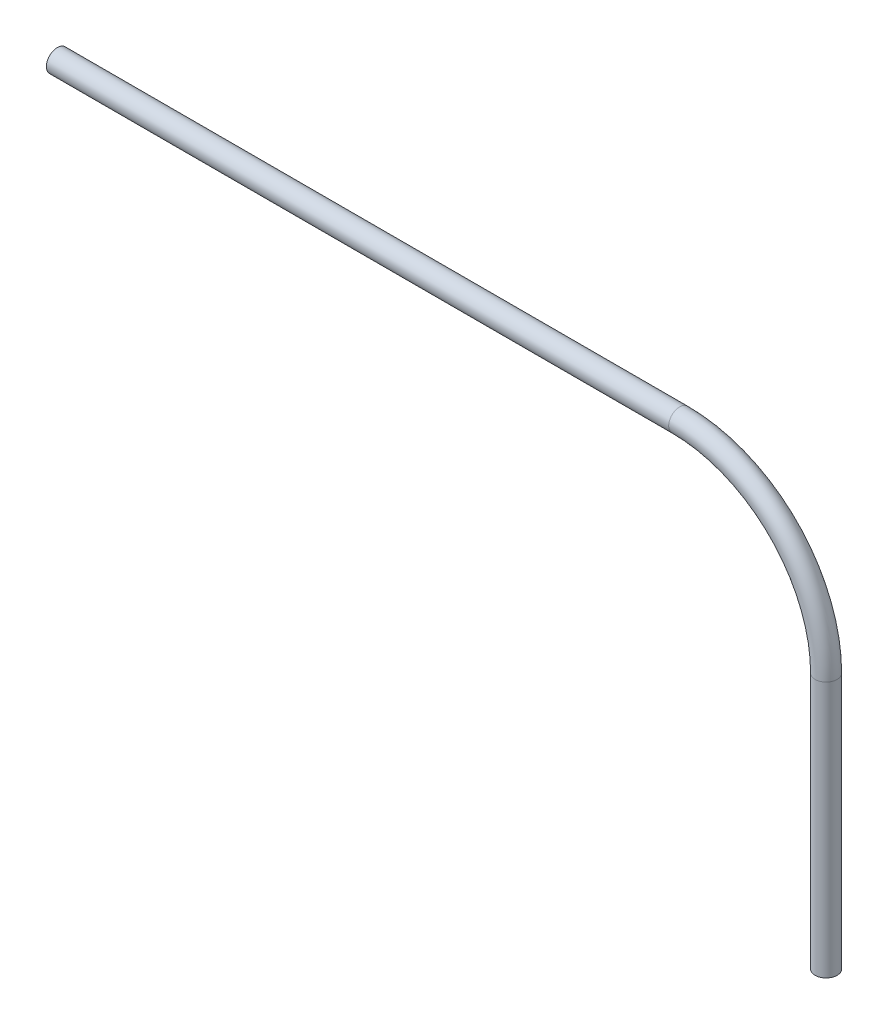
ISO-10303-21;
HEADER;
FILE_DESCRIPTION(('STEP AP214'),'2;1');
FILE_NAME('part.step','',(''),(''),'','','');
FILE_SCHEMA(('AUTOMOTIVE_DESIGN { 1 0 10303 214 1 1 1 1 }'));
ENDSEC;
DATA;
#1=APPLICATION_CONTEXT('core data for automotive mechanical design processes');
#2=APPLICATION_PROTOCOL_DEFINITION('international standard','automotive_design',2000,#1);
#3=PRODUCT_CONTEXT('',#1,'mechanical');
#4=PRODUCT('Part','Part','',(#3));
#5=PRODUCT_RELATED_PRODUCT_CATEGORY('part','',(#4));
#6=PRODUCT_DEFINITION_FORMATION('','',#4);
#7=PRODUCT_DEFINITION_CONTEXT('part definition',#1,'design');
#8=PRODUCT_DEFINITION('design','',#6,#7);
#9=PRODUCT_DEFINITION_SHAPE('','',#8);
#10=(LENGTH_UNIT() NAMED_UNIT(*) SI_UNIT(.MILLI.,.METRE.));
#11=(NAMED_UNIT(*) PLANE_ANGLE_UNIT() SI_UNIT($,.RADIAN.));
#12=(NAMED_UNIT(*) SI_UNIT($,.STERADIAN.) SOLID_ANGLE_UNIT());
#13=UNCERTAINTY_MEASURE_WITH_UNIT(LENGTH_MEASURE(1.E-05),#10,'distance_accuracy_value','');
#14=(GEOMETRIC_REPRESENTATION_CONTEXT(3) GLOBAL_UNCERTAINTY_ASSIGNED_CONTEXT((#13)) GLOBAL_UNIT_ASSIGNED_CONTEXT((#10,
#11,#12)) REPRESENTATION_CONTEXT('',''));
#15=CARTESIAN_POINT('',(0.,0.,0.));
#16=DIRECTION('',(0.,0.,1.));
#17=DIRECTION('',(1.,0.,0.));
#18=AXIS2_PLACEMENT_3D('',#15,#16,#17);
#19=CARTESIAN_POINT('',(4624.96017695695,-100.000000000001,0.));
#20=DIRECTION('',(0.,-1.,0.));
#21=DIRECTION('',(0.,0.,-1.));
#22=AXIS2_PLACEMENT_3D('',#19,#20,#21);
#23=PLANE('',#22);
#24=CARTESIAN_POINT('',(4624.96017695695,-100.000000000001,0.));
#25=DIRECTION('',(0.,-1.,0.));
#26=DIRECTION('',(1.,0.,0.));
#27=AXIS2_PLACEMENT_3D('',#24,#25,#26);
#28=CIRCLE('',#27,27.);
#29=CARTESIAN_POINT('',(4651.96017695695,-100.000000000001,0.));
#30=VERTEX_POINT('',#29);
#31=EDGE_CURVE('E70',#30,#30,#28,.T.);
#32=ORIENTED_EDGE('',*,*,#31,.F.);
#33=EDGE_LOOP('',(#32));
#34=FACE_BOUND('',#33,.T.);
#35=CARTESIAN_POINT('',(4624.96017695695,-100.000000000001,0.));
#36=DIRECTION('',(0.,-1.,0.));
#37=DIRECTION('',(0.,0.,-1.));
#38=AXIS2_PLACEMENT_3D('',#35,#36,#37);
#39=CIRCLE('',#38,30.);
#40=CARTESIAN_POINT('',(4624.96017695695,-100.000000000001,-30.));
#41=VERTEX_POINT('',#40);
#42=EDGE_CURVE('E61',#41,#41,#39,.T.);
#43=ORIENTED_EDGE('',*,*,#42,.T.);
#44=EDGE_LOOP('',(#43));
#45=FACE_BOUND('',#44,.T.);
#46=ADVANCED_FACE('F47',(#34,#45),#23,.T.);
#47=CARTESIAN_POINT('',(2524.96017695695,999.999999999999,0.));
#48=DIRECTION('',(1.,0.,0.));
#49=DIRECTION('',(0.,0.,-1.));
#50=AXIS2_PLACEMENT_3D('',#47,#48,#49);
#51=PLANE('',#50);
#52=CARTESIAN_POINT('',(2524.96017695695,999.999999999999,0.));
#53=DIRECTION('',(1.,0.,0.));
#54=DIRECTION('',(0.,0.,-1.));
#55=AXIS2_PLACEMENT_3D('',#52,#53,#54);
#56=CIRCLE('',#55,27.);
#57=CARTESIAN_POINT('',(2524.96017695695,999.999999999999,-27.));
#58=VERTEX_POINT('',#57);
#59=EDGE_CURVE('E66',#58,#58,#56,.T.);
#60=ORIENTED_EDGE('',*,*,#59,.T.);
#61=EDGE_LOOP('',(#60));
#62=FACE_BOUND('',#61,.T.);
#63=CARTESIAN_POINT('',(2524.96017695695,999.999999999999,0.));
#64=DIRECTION('',(1.,0.,0.));
#65=DIRECTION('',(0.,0.,-1.));
#66=AXIS2_PLACEMENT_3D('',#63,#64,#65);
#67=CIRCLE('',#66,30.);
#68=CARTESIAN_POINT('',(2524.96017695695,999.999999999999,-30.));
#69=VERTEX_POINT('',#68);
#70=EDGE_CURVE('E11',#69,#69,#67,.T.);
#71=ORIENTED_EDGE('',*,*,#70,.F.);
#72=EDGE_LOOP('',(#71));
#73=FACE_BOUND('',#72,.T.);
#74=ADVANCED_FACE('F90',(#62,#73),#51,.F.);
#75=CARTESIAN_POINT('',(4624.96017695695,-100.000000000001,0.));
#76=DIRECTION('',(0.,1.,0.));
#77=DIRECTION('',(0.,0.,1.));
#78=AXIS2_PLACEMENT_3D('',#75,#76,#77);
#79=CYLINDRICAL_SURFACE('',#78,30.);
#80=CARTESIAN_POINT('',(4624.96017695695,600.,0.));
#81=DIRECTION('',(0.,-1.,0.));
#82=DIRECTION('',(0.,0.,-1.));
#83=AXIS2_PLACEMENT_3D('',#80,#81,#82);
#84=CIRCLE('',#83,30.);
#85=CARTESIAN_POINT('',(4654.96017695695,600.,0.));
#86=VERTEX_POINT('',#85);
#87=EDGE_CURVE('E57',#86,#86,#84,.T.);
#88=ORIENTED_EDGE('',*,*,#87,.T.);
#89=EDGE_LOOP('',(#88));
#90=FACE_BOUND('',#89,.T.);
#91=ORIENTED_EDGE('',*,*,#42,.F.);
#92=EDGE_LOOP('',(#91));
#93=FACE_BOUND('',#92,.T.);
#94=ADVANCED_FACE('F94',(#90,#93),#79,.T.);
#95=CARTESIAN_POINT('',(4224.96017695695,600.,0.));
#96=DIRECTION('',(0.,0.,1.));
#97=DIRECTION('',(1.,0.,0.));
#98=AXIS2_PLACEMENT_3D('',#95,#96,#97);
#99=TOROIDAL_SURFACE('',#98,400.,30.);
#100=CARTESIAN_POINT('',(4224.96017695695,1000.,0.));
#101=DIRECTION('',(1.,0.,0.));
#102=DIRECTION('',(0.,0.,-1.));
#103=AXIS2_PLACEMENT_3D('',#100,#101,#102);
#104=CIRCLE('',#103,30.);
#105=CARTESIAN_POINT('',(4224.96017695695,1030.,0.));
#106=VERTEX_POINT('',#105);
#107=EDGE_CURVE('E53',#106,#106,#104,.T.);
#108=CARTESIAN_POINT('',(4224.96017695695,600.,0.));
#109=DIRECTION('',(0.,0.,1.));
#110=DIRECTION('',(1.,0.,0.));
#111=AXIS2_PLACEMENT_3D('',#108,#109,#110);
#112=CIRCLE('',#111,430.);
#113=EDGE_CURVE('',#86,#106,#112,.T.);
#114=ORIENTED_EDGE('',*,*,#87,.F.);
#115=ORIENTED_EDGE('',*,*,#107,.T.);
#116=ORIENTED_EDGE('',*,*,#113,.T.);
#117=ORIENTED_EDGE('',*,*,#113,.F.);
#118=EDGE_LOOP('',(#114,#116,#115,#117));
#119=FACE_BOUND('',#118,.T.);
#120=ADVANCED_FACE('F96',(#119),#99,.T.);
#121=CARTESIAN_POINT('',(4224.96017695695,1000.,0.));
#122=DIRECTION('',(-1.,0.,0.));
#123=DIRECTION('',(0.,-1.,0.));
#124=AXIS2_PLACEMENT_3D('',#121,#122,#123);
#125=CYLINDRICAL_SURFACE('',#124,30.);
#126=ORIENTED_EDGE('',*,*,#70,.T.);
#127=EDGE_LOOP('',(#126));
#128=FACE_BOUND('',#127,.T.);
#129=ORIENTED_EDGE('',*,*,#107,.F.);
#130=EDGE_LOOP('',(#129));
#131=FACE_BOUND('',#130,.T.);
#132=ADVANCED_FACE('F84',(#128,#131),#125,.T.);
#133=CARTESIAN_POINT('',(4624.96017695695,-100.000000000001,0.));
#134=DIRECTION('',(0.,1.,0.));
#135=DIRECTION('',(0.,0.,1.));
#136=AXIS2_PLACEMENT_3D('',#133,#134,#135);
#137=CYLINDRICAL_SURFACE('',#136,27.);
#138=CARTESIAN_POINT('',(4624.96017695695,600.,0.));
#139=DIRECTION('',(0.,1.,0.));
#140=DIRECTION('',(0.,0.,1.));
#141=AXIS2_PLACEMENT_3D('',#138,#139,#140);
#142=CIRCLE('',#141,27.);
#143=CARTESIAN_POINT('',(4651.96017695695,600.,0.));
#144=VERTEX_POINT('',#143);
#145=EDGE_CURVE('E73',#144,#144,#142,.F.);
#146=ORIENTED_EDGE('',*,*,#145,.F.);
#147=EDGE_LOOP('',(#146));
#148=FACE_BOUND('',#147,.T.);
#149=ORIENTED_EDGE('',*,*,#31,.T.);
#150=EDGE_LOOP('',(#149));
#151=FACE_BOUND('',#150,.T.);
#152=ADVANCED_FACE('F81',(#148,#151),#137,.F.);
#153=CARTESIAN_POINT('',(4224.96017695695,600.,0.));
#154=DIRECTION('',(0.,0.,1.));
#155=DIRECTION('',(1.,0.,0.));
#156=AXIS2_PLACEMENT_3D('',#153,#154,#155);
#157=TOROIDAL_SURFACE('',#156,400.,27.);
#158=CARTESIAN_POINT('',(4224.96017695695,1000.,0.));
#159=DIRECTION('',(1.,0.,0.));
#160=DIRECTION('',(0.,1.,0.));
#161=AXIS2_PLACEMENT_3D('',#158,#159,#160);
#162=CIRCLE('',#161,27.);
#163=CARTESIAN_POINT('',(4224.96017695695,1027.,0.));
#164=VERTEX_POINT('',#163);
#165=EDGE_CURVE('E69',#164,#164,#162,.T.);
#166=CARTESIAN_POINT('',(4224.96017695695,600.,0.));
#167=DIRECTION('',(0.,0.,1.));
#168=DIRECTION('',(1.,0.,0.));
#169=AXIS2_PLACEMENT_3D('',#166,#167,#168);
#170=CIRCLE('',#169,427.);
#171=EDGE_CURVE('',#144,#164,#170,.T.);
#172=ORIENTED_EDGE('',*,*,#145,.T.);
#173=ORIENTED_EDGE('',*,*,#165,.F.);
#174=ORIENTED_EDGE('',*,*,#171,.T.);
#175=ORIENTED_EDGE('',*,*,#171,.F.);
#176=EDGE_LOOP('',(#172,#174,#173,#175));
#177=FACE_BOUND('',#176,.T.);
#178=ADVANCED_FACE('F79',(#177),#157,.F.);
#179=CARTESIAN_POINT('',(4224.96017695695,1000.,0.));
#180=DIRECTION('',(-1.,0.,0.));
#181=DIRECTION('',(0.,-1.,0.));
#182=AXIS2_PLACEMENT_3D('',#179,#180,#181);
#183=CYLINDRICAL_SURFACE('',#182,27.);
#184=ORIENTED_EDGE('',*,*,#59,.F.);
#185=EDGE_LOOP('',(#184));
#186=FACE_BOUND('',#185,.T.);
#187=ORIENTED_EDGE('',*,*,#165,.T.);
#188=EDGE_LOOP('',(#187));
#189=FACE_BOUND('',#188,.T.);
#190=ADVANCED_FACE('F91',(#186,#189),#183,.F.);
#191=CLOSED_SHELL('',(#46,#74,#94,#120,#132,#152,#178,#190));
#192=MANIFOLD_SOLID_BREP('B2',#191);
#193=ADVANCED_BREP_SHAPE_REPRESENTATION('',(#18,#192),#14);
#194=SHAPE_DEFINITION_REPRESENTATION(#9,#193);
ENDSEC;
END-ISO-10303-21;
